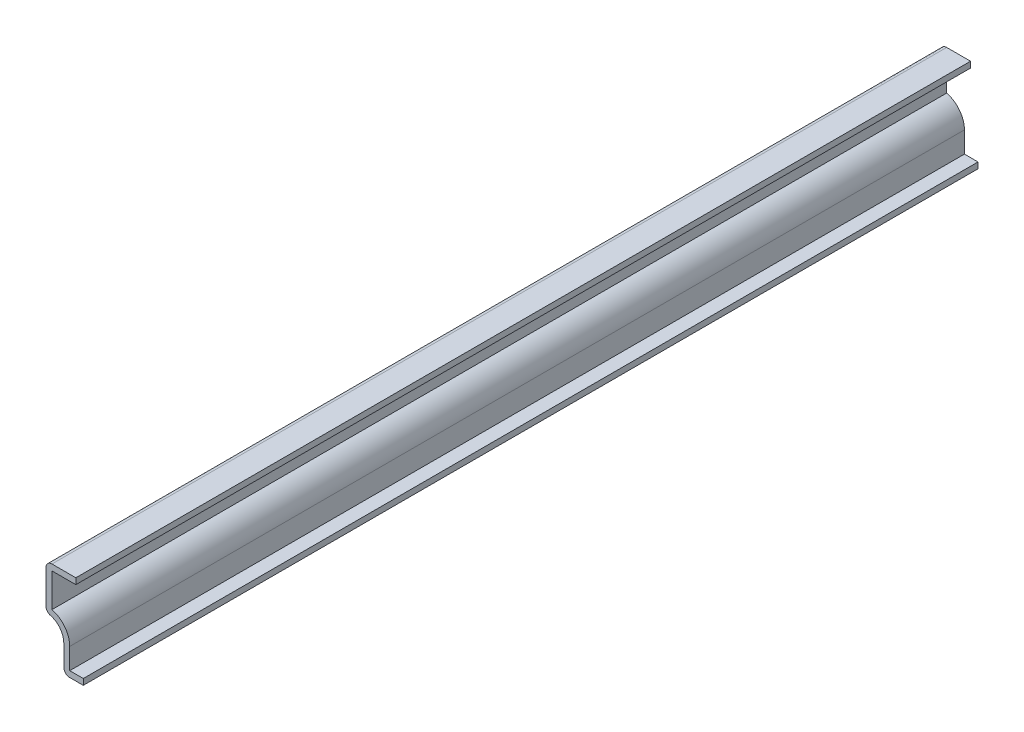
ISO-10303-21;
HEADER;
FILE_DESCRIPTION(('STEP AP214'),'2;1');
FILE_NAME('part.step','',(''),(''),'','','');
FILE_SCHEMA(('AUTOMOTIVE_DESIGN { 1 0 10303 214 1 1 1 1 }'));
ENDSEC;
DATA;
#1=APPLICATION_CONTEXT('core data for automotive mechanical design processes');
#2=APPLICATION_PROTOCOL_DEFINITION('international standard','automotive_design',2000,#1);
#3=PRODUCT_CONTEXT('',#1,'mechanical');
#4=PRODUCT('Part','Part','',(#3));
#5=PRODUCT_RELATED_PRODUCT_CATEGORY('part','',(#4));
#6=PRODUCT_DEFINITION_FORMATION('','',#4);
#7=PRODUCT_DEFINITION_CONTEXT('part definition',#1,'design');
#8=PRODUCT_DEFINITION('design','',#6,#7);
#9=PRODUCT_DEFINITION_SHAPE('','',#8);
#10=(LENGTH_UNIT() NAMED_UNIT(*) SI_UNIT(.MILLI.,.METRE.));
#11=(NAMED_UNIT(*) PLANE_ANGLE_UNIT() SI_UNIT($,.RADIAN.));
#12=(NAMED_UNIT(*) SI_UNIT($,.STERADIAN.) SOLID_ANGLE_UNIT());
#13=UNCERTAINTY_MEASURE_WITH_UNIT(LENGTH_MEASURE(1.E-05),#10,'distance_accuracy_value','');
#14=(GEOMETRIC_REPRESENTATION_CONTEXT(3) GLOBAL_UNCERTAINTY_ASSIGNED_CONTEXT((#13)) GLOBAL_UNIT_ASSIGNED_CONTEXT((#10,
#11,#12)) REPRESENTATION_CONTEXT('',''));
#15=CARTESIAN_POINT('',(0.,0.,0.));
#16=DIRECTION('',(0.,0.,1.));
#17=DIRECTION('',(1.,0.,0.));
#18=AXIS2_PLACEMENT_3D('',#15,#16,#17);
#19=CARTESIAN_POINT('',(-7.9375,17.78,-190.5));
#20=DIRECTION('',(0.,-1.,0.));
#21=DIRECTION('',(0.,0.,-1.));
#22=AXIS2_PLACEMENT_3D('',#19,#20,#21);
#23=PLANE('',#22);
#24=DIRECTION('',(1.,0.,0.));
#25=VECTOR('',#24,1.);
#26=CARTESIAN_POINT('',(-7.9375,17.78,0.));
#27=LINE('',#26,#25);
#28=CARTESIAN_POINT('',(-6.6675,17.78,0.));
#29=VERTEX_POINT('',#28);
#30=CARTESIAN_POINT('',(-1.5875,17.78,0.));
#31=VERTEX_POINT('',#30);
#32=EDGE_CURVE('E196',#29,#31,#27,.T.);
#33=ORIENTED_EDGE('',*,*,#32,.F.);
#34=DIRECTION('',(0.,0.,1.));
#35=VECTOR('',#34,1.);
#36=CARTESIAN_POINT('',(-6.6675,17.78,-190.5));
#37=LINE('',#36,#35);
#38=CARTESIAN_POINT('',(-6.6675,17.78,-190.5));
#39=VERTEX_POINT('',#38);
#40=EDGE_CURVE('E167',#39,#29,#37,.T.);
#41=ORIENTED_EDGE('',*,*,#40,.F.);
#42=DIRECTION('',(1.,0.,0.));
#43=VECTOR('',#42,1.);
#44=CARTESIAN_POINT('',(-7.9375,17.78,-190.5));
#45=LINE('',#44,#43);
#46=CARTESIAN_POINT('',(-1.5875,17.78,-190.5));
#47=VERTEX_POINT('',#46);
#48=EDGE_CURVE('E149',#39,#47,#45,.T.);
#49=ORIENTED_EDGE('',*,*,#48,.T.);
#50=DIRECTION('',(0.,0.,1.));
#51=VECTOR('',#50,1.);
#52=CARTESIAN_POINT('',(-1.5875,17.78,-190.5));
#53=LINE('',#52,#51);
#54=EDGE_CURVE('E157',#47,#31,#53,.T.);
#55=ORIENTED_EDGE('',*,*,#54,.T.);
#56=EDGE_LOOP('',(#33,#41,#49,#55));
#57=FACE_BOUND('',#56,.T.);
#58=ADVANCED_FACE('F35',(#57),#23,.T.);
#59=CARTESIAN_POINT('',(-6.6675,9.525,-190.5));
#60=DIRECTION('',(1.,0.,0.));
#61=DIRECTION('',(0.,1.,0.));
#62=AXIS2_PLACEMENT_3D('',#59,#60,#61);
#63=PLANE('',#62);
#64=DIRECTION('',(0.,1.,0.));
#65=VECTOR('',#64,1.);
#66=CARTESIAN_POINT('',(-6.6675,9.525,0.));
#67=LINE('',#66,#65);
#68=CARTESIAN_POINT('',(-6.6675,10.6327815450255,0.));
#69=VERTEX_POINT('',#68);
#70=EDGE_CURVE('E168',#69,#29,#67,.T.);
#71=ORIENTED_EDGE('',*,*,#70,.F.);
#72=DIRECTION('',(0.,0.,1.));
#73=VECTOR('',#72,1.);
#74=CARTESIAN_POINT('',(-6.6675,10.6327815450255,-190.5));
#75=LINE('',#74,#73);
#76=CARTESIAN_POINT('',(-6.6675,10.6327815450255,-190.5));
#77=VERTEX_POINT('',#76);
#78=EDGE_CURVE('E223',#77,#69,#75,.T.);
#79=ORIENTED_EDGE('',*,*,#78,.F.);
#80=DIRECTION('',(0.,1.,0.));
#81=VECTOR('',#80,1.);
#82=CARTESIAN_POINT('',(-6.6675,9.525,-190.5));
#83=LINE('',#82,#81);
#84=EDGE_CURVE('E165',#77,#39,#83,.T.);
#85=ORIENTED_EDGE('',*,*,#84,.T.);
#86=ORIENTED_EDGE('',*,*,#40,.T.);
#87=EDGE_LOOP('',(#71,#79,#85,#86));
#88=FACE_BOUND('',#87,.T.);
#89=ADVANCED_FACE('F280',(#88),#63,.T.);
#90=CARTESIAN_POINT('',(-7.9375,5.7425082,-190.5));
#91=DIRECTION('',(0.,0.,1.));
#92=DIRECTION('',(1.,0.,0.));
#93=AXIS2_PLACEMENT_3D('',#90,#91,#92);
#94=CYLINDRICAL_SURFACE('',#93,5.0524918);
#95=CARTESIAN_POINT('',(-7.9375,5.7425082,0.));
#96=DIRECTION('',(0.,0.,1.));
#97=DIRECTION('',(1.,0.,0.));
#98=AXIS2_PLACEMENT_3D('',#95,#96,#97);
#99=CIRCLE('',#98,5.0524918);
#100=CARTESIAN_POINT('',(-2.8850082,5.7425082,0.));
#101=VERTEX_POINT('',#100);
#102=EDGE_CURVE('E171',#101,#69,#99,.T.);
#103=ORIENTED_EDGE('',*,*,#102,.F.);
#104=DIRECTION('',(0.,0.,1.));
#105=VECTOR('',#104,1.);
#106=CARTESIAN_POINT('',(-2.8850082,5.7425082,-190.5));
#107=LINE('',#106,#105);
#108=CARTESIAN_POINT('',(-2.8850082,5.7425082,-190.5));
#109=VERTEX_POINT('',#108);
#110=EDGE_CURVE('E225',#109,#101,#107,.T.);
#111=ORIENTED_EDGE('',*,*,#110,.F.);
#112=CARTESIAN_POINT('',(-7.9375,5.7425082,-190.5));
#113=DIRECTION('',(0.,0.,1.));
#114=DIRECTION('',(1.,0.,0.));
#115=AXIS2_PLACEMENT_3D('',#112,#113,#114);
#116=CIRCLE('',#115,5.0524918);
#117=EDGE_CURVE('E192',#109,#77,#116,.T.);
#118=ORIENTED_EDGE('',*,*,#117,.T.);
#119=ORIENTED_EDGE('',*,*,#78,.T.);
#120=EDGE_LOOP('',(#103,#111,#118,#119));
#121=FACE_BOUND('',#120,.T.);
#122=ADVANCED_FACE('F320',(#121),#94,.T.);
#123=CARTESIAN_POINT('',(-2.8850082,0.,-190.5));
#124=DIRECTION('',(1.,0.,0.));
#125=DIRECTION('',(0.,1.,0.));
#126=AXIS2_PLACEMENT_3D('',#123,#124,#125);
#127=PLANE('',#126);
#128=DIRECTION('',(0.,1.,0.));
#129=VECTOR('',#128,1.);
#130=CARTESIAN_POINT('',(-2.8850082,0.,0.));
#131=LINE('',#130,#129);
#132=CARTESIAN_POINT('',(-2.8850082,1.27,0.));
#133=VERTEX_POINT('',#132);
#134=EDGE_CURVE('E216',#133,#101,#131,.T.);
#135=ORIENTED_EDGE('',*,*,#134,.F.);
#136=DIRECTION('',(0.,0.,1.));
#137=VECTOR('',#136,1.);
#138=CARTESIAN_POINT('',(-2.8850082,1.27,-190.5));
#139=LINE('',#138,#137);
#140=CARTESIAN_POINT('',(-2.8850082,1.27,-190.5));
#141=VERTEX_POINT('',#140);
#142=EDGE_CURVE('E227',#141,#133,#139,.T.);
#143=ORIENTED_EDGE('',*,*,#142,.F.);
#144=DIRECTION('',(0.,1.,0.));
#145=VECTOR('',#144,1.);
#146=CARTESIAN_POINT('',(-2.8850082,0.,-190.5));
#147=LINE('',#146,#145);
#148=EDGE_CURVE('E189',#141,#109,#147,.T.);
#149=ORIENTED_EDGE('',*,*,#148,.T.);
#150=ORIENTED_EDGE('',*,*,#110,.T.);
#151=EDGE_LOOP('',(#135,#143,#149,#150));
#152=FACE_BOUND('',#151,.T.);
#153=ADVANCED_FACE('F287',(#152),#127,.T.);
#154=CARTESIAN_POINT('',(0.,1.27,-190.5));
#155=DIRECTION('',(0.,1.,0.));
#156=DIRECTION('',(-1.,0.,0.));
#157=AXIS2_PLACEMENT_3D('',#154,#155,#156);
#158=PLANE('',#157);
#159=DIRECTION('',(-1.,0.,0.));
#160=VECTOR('',#159,1.);
#161=CARTESIAN_POINT('',(0.,1.27,0.));
#162=LINE('',#161,#160);
#163=CARTESIAN_POINT('',(0.,1.27,0.));
#164=VERTEX_POINT('',#163);
#165=EDGE_CURVE('E213',#164,#133,#162,.T.);
#166=ORIENTED_EDGE('',*,*,#165,.F.);
#167=DIRECTION('',(0.,0.,1.));
#168=VECTOR('',#167,1.);
#169=CARTESIAN_POINT('',(0.,1.27,-190.5));
#170=LINE('',#169,#168);
#171=CARTESIAN_POINT('',(0.,1.27,-190.5));
#172=VERTEX_POINT('',#171);
#173=EDGE_CURVE('E229',#172,#164,#170,.T.);
#174=ORIENTED_EDGE('',*,*,#173,.F.);
#175=DIRECTION('',(-1.,0.,0.));
#176=VECTOR('',#175,1.);
#177=CARTESIAN_POINT('',(0.,1.27,-190.5));
#178=LINE('',#177,#176);
#179=EDGE_CURVE('E186',#172,#141,#178,.T.);
#180=ORIENTED_EDGE('',*,*,#179,.T.);
#181=ORIENTED_EDGE('',*,*,#142,.T.);
#182=EDGE_LOOP('',(#166,#174,#180,#181));
#183=FACE_BOUND('',#182,.T.);
#184=ADVANCED_FACE('F290',(#183),#158,.T.);
#185=CARTESIAN_POINT('',(0.,1.27,-190.5));
#186=DIRECTION('',(-1.,0.,0.));
#187=DIRECTION('',(0.,-1.,0.));
#188=AXIS2_PLACEMENT_3D('',#185,#186,#187);
#189=PLANE('',#188);
#190=DIRECTION('',(0.,-1.,0.));
#191=VECTOR('',#190,1.);
#192=CARTESIAN_POINT('',(0.,1.27,0.));
#193=LINE('',#192,#191);
#194=CARTESIAN_POINT('',(0.,0.,0.));
#195=VERTEX_POINT('',#194);
#196=EDGE_CURVE('E211',#164,#195,#193,.T.);
#197=ORIENTED_EDGE('',*,*,#196,.T.);
#198=DIRECTION('',(0.,0.,1.));
#199=VECTOR('',#198,1.);
#200=CARTESIAN_POINT('',(0.,0.,-190.5));
#201=LINE('',#200,#199);
#202=CARTESIAN_POINT('',(0.,0.,-190.5));
#203=VERTEX_POINT('',#202);
#204=EDGE_CURVE('E231',#203,#195,#201,.T.);
#205=ORIENTED_EDGE('',*,*,#204,.F.);
#206=DIRECTION('',(0.,-1.,0.));
#207=VECTOR('',#206,1.);
#208=CARTESIAN_POINT('',(0.,1.27,-190.5));
#209=LINE('',#208,#207);
#210=EDGE_CURVE('E184',#172,#203,#209,.T.);
#211=ORIENTED_EDGE('',*,*,#210,.F.);
#212=ORIENTED_EDGE('',*,*,#173,.T.);
#213=EDGE_LOOP('',(#197,#205,#211,#212));
#214=FACE_BOUND('',#213,.T.);
#215=ADVANCED_FACE('F296',(#214),#189,.F.);
#216=CARTESIAN_POINT('',(0.,0.,-190.5));
#217=DIRECTION('',(0.,1.,0.));
#218=DIRECTION('',(-1.,0.,0.));
#219=AXIS2_PLACEMENT_3D('',#216,#217,#218);
#220=PLANE('',#219);
#221=DIRECTION('',(-1.,0.,0.));
#222=VECTOR('',#221,1.);
#223=CARTESIAN_POINT('',(0.,0.,0.));
#224=LINE('',#223,#222);
#225=CARTESIAN_POINT('',(-2.8850082,0.,0.));
#226=VERTEX_POINT('',#225);
#227=EDGE_CURVE('E208',#195,#226,#224,.T.);
#228=ORIENTED_EDGE('',*,*,#227,.T.);
#229=DIRECTION('',(0.,0.,1.));
#230=VECTOR('',#229,1.);
#231=CARTESIAN_POINT('',(-2.8850082,0.,-190.5));
#232=LINE('',#231,#230);
#233=CARTESIAN_POINT('',(-2.8850082,0.,-190.5));
#234=VERTEX_POINT('',#233);
#235=EDGE_CURVE('E246',#226,#234,#232,.F.);
#236=ORIENTED_EDGE('',*,*,#235,.T.);
#237=DIRECTION('',(-1.,0.,0.));
#238=VECTOR('',#237,1.);
#239=CARTESIAN_POINT('',(0.,0.,-190.5));
#240=LINE('',#239,#238);
#241=EDGE_CURVE('E182',#203,#234,#240,.T.);
#242=ORIENTED_EDGE('',*,*,#241,.F.);
#243=ORIENTED_EDGE('',*,*,#204,.T.);
#244=EDGE_LOOP('',(#228,#236,#242,#243));
#245=FACE_BOUND('',#244,.T.);
#246=ADVANCED_FACE('F300',(#245),#220,.F.);
#247=CARTESIAN_POINT('',(-4.1550082,0.,-190.5));
#248=DIRECTION('',(1.,0.,0.));
#249=DIRECTION('',(0.,1.,0.));
#250=AXIS2_PLACEMENT_3D('',#247,#248,#249);
#251=PLANE('',#250);
#252=DIRECTION('',(0.,1.,0.));
#253=VECTOR('',#252,1.);
#254=CARTESIAN_POINT('',(-4.1550082,0.,-190.5));
#255=LINE('',#254,#253);
#256=CARTESIAN_POINT('',(-4.1550082,1.27,-190.5));
#257=VERTEX_POINT('',#256);
#258=CARTESIAN_POINT('',(-4.1550082,5.7425082,-190.5));
#259=VERTEX_POINT('',#258);
#260=EDGE_CURVE('E180',#257,#259,#255,.T.);
#261=ORIENTED_EDGE('',*,*,#260,.F.);
#262=DIRECTION('',(0.,0.,1.));
#263=VECTOR('',#262,1.);
#264=CARTESIAN_POINT('',(-4.1550082,1.27,-190.5));
#265=LINE('',#264,#263);
#266=CARTESIAN_POINT('',(-4.1550082,1.27,0.));
#267=VERTEX_POINT('',#266);
#268=EDGE_CURVE('E222',#257,#267,#265,.T.);
#269=ORIENTED_EDGE('',*,*,#268,.T.);
#270=DIRECTION('',(0.,1.,0.));
#271=VECTOR('',#270,1.);
#272=CARTESIAN_POINT('',(-4.1550082,0.,0.));
#273=LINE('',#272,#271);
#274=CARTESIAN_POINT('',(-4.1550082,5.7425082,0.));
#275=VERTEX_POINT('',#274);
#276=EDGE_CURVE('E206',#267,#275,#273,.T.);
#277=ORIENTED_EDGE('',*,*,#276,.T.);
#278=DIRECTION('',(0.,0.,1.));
#279=VECTOR('',#278,1.);
#280=CARTESIAN_POINT('',(-4.1550082,5.7425082,-190.5));
#281=LINE('',#280,#279);
#282=EDGE_CURVE('E234',#259,#275,#281,.T.);
#283=ORIENTED_EDGE('',*,*,#282,.F.);
#284=EDGE_LOOP('',(#261,#269,#277,#283));
#285=FACE_BOUND('',#284,.T.);
#286=ADVANCED_FACE('F306',(#285),#251,.F.);
#287=CARTESIAN_POINT('',(-7.9375,5.7425082,-190.5));
#288=DIRECTION('',(0.,0.,1.));
#289=DIRECTION('',(1.,0.,0.));
#290=AXIS2_PLACEMENT_3D('',#287,#288,#289);
#291=CYLINDRICAL_SURFACE('',#290,3.7824918);
#292=CARTESIAN_POINT('',(-7.9375,5.7425082,0.));
#293=DIRECTION('',(0.,0.,1.));
#294=DIRECTION('',(1.,0.,0.));
#295=AXIS2_PLACEMENT_3D('',#292,#293,#294);
#296=CIRCLE('',#295,3.7824918);
#297=CARTESIAN_POINT('',(-6.98672862299351,9.4035569576284,0.));
#298=VERTEX_POINT('',#297);
#299=EDGE_CURVE('E203',#275,#298,#296,.T.);
#300=ORIENTED_EDGE('',*,*,#299,.T.);
#301=DIRECTION('',(0.,0.,1.));
#302=VECTOR('',#301,1.);
#303=CARTESIAN_POINT('',(-6.98672862299351,9.4035569576284,-190.5));
#304=LINE('',#303,#302);
#305=CARTESIAN_POINT('',(-6.98672862299351,9.4035569576284,-190.5));
#306=VERTEX_POINT('',#305);
#307=EDGE_CURVE('E43',#298,#306,#304,.F.);
#308=ORIENTED_EDGE('',*,*,#307,.T.);
#309=CARTESIAN_POINT('',(-7.9375,5.7425082,-190.5));
#310=DIRECTION('',(0.,0.,1.));
#311=DIRECTION('',(1.,0.,0.));
#312=AXIS2_PLACEMENT_3D('',#309,#310,#311);
#313=CIRCLE('',#312,3.7824918);
#314=EDGE_CURVE('E177',#259,#306,#313,.T.);
#315=ORIENTED_EDGE('',*,*,#314,.F.);
#316=ORIENTED_EDGE('',*,*,#282,.T.);
#317=EDGE_LOOP('',(#300,#308,#315,#316));
#318=FACE_BOUND('',#317,.T.);
#319=ADVANCED_FACE('F259',(#318),#291,.F.);
#320=CARTESIAN_POINT('',(-7.9375,9.525,-190.5));
#321=DIRECTION('',(1.,0.,0.));
#322=DIRECTION('',(0.,1.,0.));
#323=AXIS2_PLACEMENT_3D('',#320,#321,#322);
#324=PLANE('',#323);
#325=DIRECTION('',(0.,1.,0.));
#326=VECTOR('',#325,1.);
#327=CARTESIAN_POINT('',(-7.9375,9.525,-190.5));
#328=LINE('',#327,#326);
#329=CARTESIAN_POINT('',(-7.9375,10.6327815450255,-190.5));
#330=VERTEX_POINT('',#329);
#331=CARTESIAN_POINT('',(-7.9375,17.78,-190.5));
#332=VERTEX_POINT('',#331);
#333=EDGE_CURVE('E175',#330,#332,#328,.T.);
#334=ORIENTED_EDGE('',*,*,#333,.F.);
#335=DIRECTION('',(0.,0.,1.));
#336=VECTOR('',#335,1.);
#337=CARTESIAN_POINT('',(-7.9375,10.6327815450255,-190.5));
#338=LINE('',#337,#336);
#339=CARTESIAN_POINT('',(-7.9375,10.6327815450255,0.));
#340=VERTEX_POINT('',#339);
#341=EDGE_CURVE('E254',#330,#340,#338,.T.);
#342=ORIENTED_EDGE('',*,*,#341,.T.);
#343=DIRECTION('',(0.,1.,0.));
#344=VECTOR('',#343,1.);
#345=CARTESIAN_POINT('',(-7.9375,9.525,0.));
#346=LINE('',#345,#344);
#347=CARTESIAN_POINT('',(-7.9375,17.78,0.));
#348=VERTEX_POINT('',#347);
#349=EDGE_CURVE('E201',#340,#348,#346,.T.);
#350=ORIENTED_EDGE('',*,*,#349,.T.);
#351=DIRECTION('',(0.,0.,1.));
#352=VECTOR('',#351,1.);
#353=CARTESIAN_POINT('',(-7.9375,17.78,-190.5));
#354=LINE('',#353,#352);
#355=EDGE_CURVE('E58',#348,#332,#354,.F.);
#356=ORIENTED_EDGE('',*,*,#355,.T.);
#357=EDGE_LOOP('',(#334,#342,#350,#356));
#358=FACE_BOUND('',#357,.T.);
#359=ADVANCED_FACE('F268',(#358),#324,.F.);
#360=CARTESIAN_POINT('',(-7.9375,19.05,-190.5));
#361=DIRECTION('',(0.,-1.,0.));
#362=DIRECTION('',(0.,0.,-1.));
#363=AXIS2_PLACEMENT_3D('',#360,#361,#362);
#364=PLANE('',#363);
#365=DIRECTION('',(1.,0.,0.));
#366=VECTOR('',#365,1.);
#367=CARTESIAN_POINT('',(-7.9375,19.05,-190.5));
#368=LINE('',#367,#366);
#369=CARTESIAN_POINT('',(-6.6675,19.05,-190.5));
#370=VERTEX_POINT('',#369);
#371=CARTESIAN_POINT('',(-1.5875,19.05,-190.5));
#372=VERTEX_POINT('',#371);
#373=EDGE_CURVE('E151',#370,#372,#368,.T.);
#374=ORIENTED_EDGE('',*,*,#373,.F.);
#375=DIRECTION('',(0.,0.,1.));
#376=VECTOR('',#375,1.);
#377=CARTESIAN_POINT('',(-6.6675,19.05,-190.5));
#378=LINE('',#377,#376);
#379=CARTESIAN_POINT('',(-6.6675,19.05,0.));
#380=VERTEX_POINT('',#379);
#381=EDGE_CURVE('E11',#370,#380,#378,.T.);
#382=ORIENTED_EDGE('',*,*,#381,.T.);
#383=DIRECTION('',(1.,0.,0.));
#384=VECTOR('',#383,1.);
#385=CARTESIAN_POINT('',(-7.9375,19.05,0.));
#386=LINE('',#385,#384);
#387=CARTESIAN_POINT('',(-1.5875,19.05,0.));
#388=VERTEX_POINT('',#387);
#389=EDGE_CURVE('E199',#380,#388,#386,.T.);
#390=ORIENTED_EDGE('',*,*,#389,.T.);
#391=DIRECTION('',(0.,0.,1.));
#392=VECTOR('',#391,1.);
#393=CARTESIAN_POINT('',(-1.5875,19.05,-190.5));
#394=LINE('',#393,#392);
#395=EDGE_CURVE('E164',#372,#388,#394,.T.);
#396=ORIENTED_EDGE('',*,*,#395,.F.);
#397=EDGE_LOOP('',(#374,#382,#390,#396));
#398=FACE_BOUND('',#397,.T.);
#399=ADVANCED_FACE('F276',(#398),#364,.F.);
#400=CARTESIAN_POINT('',(-1.5875,19.05,-190.5));
#401=DIRECTION('',(-1.,0.,0.));
#402=DIRECTION('',(0.,0.,1.));
#403=AXIS2_PLACEMENT_3D('',#400,#401,#402);
#404=PLANE('',#403);
#405=DIRECTION('',(0.,-1.,0.));
#406=VECTOR('',#405,1.);
#407=CARTESIAN_POINT('',(-1.5875,19.05,0.));
#408=LINE('',#407,#406);
#409=EDGE_CURVE('E160',#388,#31,#408,.T.);
#410=ORIENTED_EDGE('',*,*,#409,.T.);
#411=ORIENTED_EDGE('',*,*,#54,.F.);
#412=DIRECTION('',(0.,-1.,0.));
#413=VECTOR('',#412,1.);
#414=CARTESIAN_POINT('',(-1.5875,19.05,-190.5));
#415=LINE('',#414,#413);
#416=EDGE_CURVE('E143',#372,#47,#415,.T.);
#417=ORIENTED_EDGE('',*,*,#416,.F.);
#418=ORIENTED_EDGE('',*,*,#395,.T.);
#419=EDGE_LOOP('',(#410,#411,#417,#418));
#420=FACE_BOUND('',#419,.T.);
#421=ADVANCED_FACE('F158',(#420),#404,.F.);
#422=CARTESIAN_POINT('',(-7.9375,5.7425082,-190.5));
#423=DIRECTION('',(0.,0.,1.));
#424=DIRECTION('',(1.,0.,0.));
#425=AXIS2_PLACEMENT_3D('',#422,#423,#424);
#426=PLANE('',#425);
#427=ORIENTED_EDGE('',*,*,#241,.T.);
#428=CARTESIAN_POINT('',(-2.8850082,1.27,-190.5));
#429=DIRECTION('',(0.,0.,1.));
#430=DIRECTION('',(1.,0.,0.));
#431=AXIS2_PLACEMENT_3D('',#428,#429,#430);
#432=CIRCLE('',#431,1.27);
#433=EDGE_CURVE('E251',#234,#257,#432,.F.);
#434=ORIENTED_EDGE('',*,*,#433,.T.);
#435=ORIENTED_EDGE('',*,*,#260,.T.);
#436=ORIENTED_EDGE('',*,*,#314,.T.);
#437=CARTESIAN_POINT('',(-6.6675,10.6327815450255,-190.5));
#438=DIRECTION('',(0.,0.,1.));
#439=DIRECTION('',(1.,0.,0.));
#440=AXIS2_PLACEMENT_3D('',#437,#438,#439);
#441=CIRCLE('',#440,1.27);
#442=EDGE_CURVE('E249',#306,#330,#441,.F.);
#443=ORIENTED_EDGE('',*,*,#442,.T.);
#444=ORIENTED_EDGE('',*,*,#333,.T.);
#445=CARTESIAN_POINT('',(-6.6675,17.78,-190.5));
#446=DIRECTION('',(0.,0.,1.));
#447=DIRECTION('',(1.,0.,0.));
#448=AXIS2_PLACEMENT_3D('',#445,#446,#447);
#449=CIRCLE('',#448,1.27);
#450=EDGE_CURVE('E50',#332,#370,#449,.F.);
#451=ORIENTED_EDGE('',*,*,#450,.T.);
#452=ORIENTED_EDGE('',*,*,#373,.T.);
#453=ORIENTED_EDGE('',*,*,#416,.T.);
#454=ORIENTED_EDGE('',*,*,#48,.F.);
#455=ORIENTED_EDGE('',*,*,#84,.F.);
#456=ORIENTED_EDGE('',*,*,#117,.F.);
#457=ORIENTED_EDGE('',*,*,#148,.F.);
#458=ORIENTED_EDGE('',*,*,#179,.F.);
#459=ORIENTED_EDGE('',*,*,#210,.T.);
#460=EDGE_LOOP('',(#427,#434,#435,#436,#443,#444,#451,#452,#453,#454,#455,#456,#457,#458,#459));
#461=FACE_BOUND('',#460,.T.);
#462=ADVANCED_FACE('F146',(#461),#426,.F.);
#463=CARTESIAN_POINT('',(-7.9375,5.7425082,0.));
#464=DIRECTION('',(0.,0.,1.));
#465=DIRECTION('',(1.,0.,0.));
#466=AXIS2_PLACEMENT_3D('',#463,#464,#465);
#467=PLANE('',#466);
#468=ORIENTED_EDGE('',*,*,#276,.F.);
#469=CARTESIAN_POINT('',(-2.8850082,1.27,0.));
#470=DIRECTION('',(0.,0.,1.));
#471=DIRECTION('',(1.,0.,0.));
#472=AXIS2_PLACEMENT_3D('',#469,#470,#471);
#473=CIRCLE('',#472,1.27);
#474=EDGE_CURVE('E244',#267,#226,#473,.T.);
#475=ORIENTED_EDGE('',*,*,#474,.T.);
#476=ORIENTED_EDGE('',*,*,#227,.F.);
#477=ORIENTED_EDGE('',*,*,#196,.F.);
#478=ORIENTED_EDGE('',*,*,#165,.T.);
#479=ORIENTED_EDGE('',*,*,#134,.T.);
#480=ORIENTED_EDGE('',*,*,#102,.T.);
#481=ORIENTED_EDGE('',*,*,#70,.T.);
#482=ORIENTED_EDGE('',*,*,#32,.T.);
#483=ORIENTED_EDGE('',*,*,#409,.F.);
#484=ORIENTED_EDGE('',*,*,#389,.F.);
#485=CARTESIAN_POINT('',(-6.6675,17.78,0.));
#486=DIRECTION('',(0.,0.,1.));
#487=DIRECTION('',(1.,0.,0.));
#488=AXIS2_PLACEMENT_3D('',#485,#486,#487);
#489=CIRCLE('',#488,1.27);
#490=EDGE_CURVE('E240',#380,#348,#489,.T.);
#491=ORIENTED_EDGE('',*,*,#490,.T.);
#492=ORIENTED_EDGE('',*,*,#349,.F.);
#493=CARTESIAN_POINT('',(-6.6675,10.6327815450255,0.));
#494=DIRECTION('',(0.,0.,1.));
#495=DIRECTION('',(1.,0.,0.));
#496=AXIS2_PLACEMENT_3D('',#493,#494,#495);
#497=CIRCLE('',#496,1.27);
#498=EDGE_CURVE('E242',#340,#298,#497,.T.);
#499=ORIENTED_EDGE('',*,*,#498,.T.);
#500=ORIENTED_EDGE('',*,*,#299,.F.);
#501=EDGE_LOOP('',(#468,#475,#476,#477,#478,#479,#480,#481,#482,#483,#484,#491,#492,#499,#500));
#502=FACE_BOUND('',#501,.T.);
#503=ADVANCED_FACE('F271',(#502),#467,.T.);
#504=CARTESIAN_POINT('',(-2.8850082,1.27,-190.5));
#505=DIRECTION('',(0.,0.,1.));
#506=DIRECTION('',(1.,0.,0.));
#507=AXIS2_PLACEMENT_3D('',#504,#505,#506);
#508=CYLINDRICAL_SURFACE('',#507,1.27);
#509=ORIENTED_EDGE('',*,*,#433,.F.);
#510=ORIENTED_EDGE('',*,*,#235,.F.);
#511=ORIENTED_EDGE('',*,*,#474,.F.);
#512=ORIENTED_EDGE('',*,*,#268,.F.);
#513=EDGE_LOOP('',(#509,#510,#511,#512));
#514=FACE_BOUND('',#513,.T.);
#515=ADVANCED_FACE('F303',(#514),#508,.T.);
#516=CARTESIAN_POINT('',(-6.6675,10.6327815450255,-190.5));
#517=DIRECTION('',(0.,0.,1.));
#518=DIRECTION('',(1.,0.,0.));
#519=AXIS2_PLACEMENT_3D('',#516,#517,#518);
#520=CYLINDRICAL_SURFACE('',#519,1.27);
#521=ORIENTED_EDGE('',*,*,#442,.F.);
#522=ORIENTED_EDGE('',*,*,#307,.F.);
#523=ORIENTED_EDGE('',*,*,#498,.F.);
#524=ORIENTED_EDGE('',*,*,#341,.F.);
#525=EDGE_LOOP('',(#521,#522,#523,#524));
#526=FACE_BOUND('',#525,.T.);
#527=ADVANCED_FACE('F266',(#526),#520,.T.);
#528=CARTESIAN_POINT('',(-6.6675,17.78,-190.5));
#529=DIRECTION('',(0.,0.,1.));
#530=DIRECTION('',(1.,0.,0.));
#531=AXIS2_PLACEMENT_3D('',#528,#529,#530);
#532=CYLINDRICAL_SURFACE('',#531,1.27);
#533=ORIENTED_EDGE('',*,*,#450,.F.);
#534=ORIENTED_EDGE('',*,*,#355,.F.);
#535=ORIENTED_EDGE('',*,*,#490,.F.);
#536=ORIENTED_EDGE('',*,*,#381,.F.);
#537=EDGE_LOOP('',(#533,#534,#535,#536));
#538=FACE_BOUND('',#537,.T.);
#539=ADVANCED_FACE('F37',(#538),#532,.T.);
#540=CLOSED_SHELL('',(#58,#89,#122,#153,#184,#215,#246,#286,#319,#359,#399,#421,#462,#503,#515,
#527,#539));
#541=MANIFOLD_SOLID_BREP('B2',#540);
#542=ADVANCED_BREP_SHAPE_REPRESENTATION('',(#18,#541),#14);
#543=SHAPE_DEFINITION_REPRESENTATION(#9,#542);
ENDSEC;
END-ISO-10303-21;
